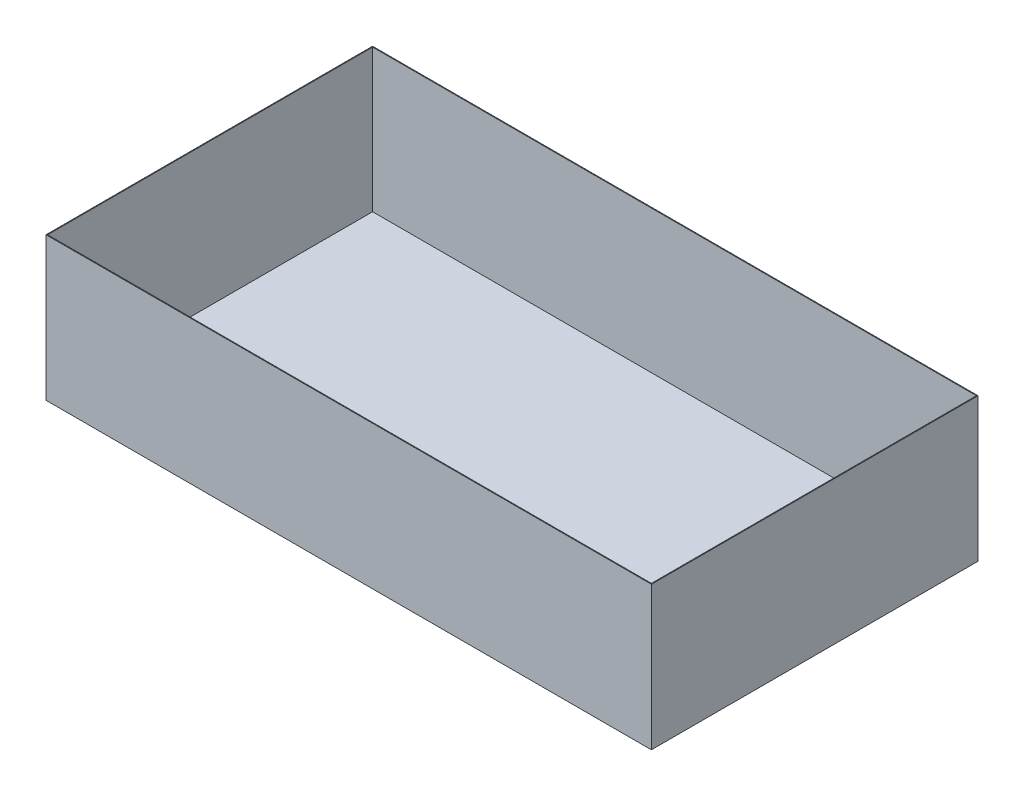
ISO-10303-21;
HEADER;
FILE_DESCRIPTION(('STEP AP214'),'2;1');
FILE_NAME('part.step','',(''),(''),'','','');
FILE_SCHEMA(('AUTOMOTIVE_DESIGN { 1 0 10303 214 1 1 1 1 }'));
ENDSEC;
DATA;
#1=APPLICATION_CONTEXT('core data for automotive mechanical design processes');
#2=APPLICATION_PROTOCOL_DEFINITION('international standard','automotive_design',2000,#1);
#3=PRODUCT_CONTEXT('',#1,'mechanical');
#4=PRODUCT('Part','Part','',(#3));
#5=PRODUCT_RELATED_PRODUCT_CATEGORY('part','',(#4));
#6=PRODUCT_DEFINITION_FORMATION('','',#4);
#7=PRODUCT_DEFINITION_CONTEXT('part definition',#1,'design');
#8=PRODUCT_DEFINITION('design','',#6,#7);
#9=PRODUCT_DEFINITION_SHAPE('','',#8);
#10=(LENGTH_UNIT() NAMED_UNIT(*) SI_UNIT(.MILLI.,.METRE.));
#11=(NAMED_UNIT(*) PLANE_ANGLE_UNIT() SI_UNIT($,.RADIAN.));
#12=(NAMED_UNIT(*) SI_UNIT($,.STERADIAN.) SOLID_ANGLE_UNIT());
#13=UNCERTAINTY_MEASURE_WITH_UNIT(LENGTH_MEASURE(1.E-05),#10,'distance_accuracy_value','');
#14=(GEOMETRIC_REPRESENTATION_CONTEXT(3) GLOBAL_UNCERTAINTY_ASSIGNED_CONTEXT((#13)) GLOBAL_UNIT_ASSIGNED_CONTEXT((#10,
#11,#12)) REPRESENTATION_CONTEXT('',''));
#15=CARTESIAN_POINT('',(0.,0.,0.));
#16=DIRECTION('',(0.,0.,1.));
#17=DIRECTION('',(1.,0.,0.));
#18=AXIS2_PLACEMENT_3D('',#15,#16,#17);
#19=CARTESIAN_POINT('',(-224.976152623211,180.,-90.5802861685215));
#20=DIRECTION('',(1.,0.,0.));
#21=DIRECTION('',(0.,0.,-1.));
#22=AXIS2_PLACEMENT_3D('',#19,#20,#21);
#23=PLANE('',#22);
#24=DIRECTION('',(0.,0.,1.));
#25=VECTOR('',#24,1.);
#26=CARTESIAN_POINT('',(-224.976152623211,0.,-90.5802861685215));
#27=LINE('',#26,#25);
#28=CARTESIAN_POINT('',(-224.976152623211,0.,-90.5802861685215));
#29=VERTEX_POINT('',#28);
#30=CARTESIAN_POINT('',(-224.976152623211,0.,319.419713831478));
#31=VERTEX_POINT('',#30);
#32=EDGE_CURVE('E151',#29,#31,#27,.T.);
#33=ORIENTED_EDGE('',*,*,#32,.T.);
#34=DIRECTION('',(0.,-1.,0.));
#35=VECTOR('',#34,1.);
#36=CARTESIAN_POINT('',(-224.976152623211,180.,319.419713831478));
#37=LINE('',#36,#35);
#38=CARTESIAN_POINT('',(-224.976152623211,180.,319.419713831478));
#39=VERTEX_POINT('',#38);
#40=EDGE_CURVE('E11',#39,#31,#37,.T.);
#41=ORIENTED_EDGE('',*,*,#40,.F.);
#42=DIRECTION('',(0.,0.,1.));
#43=VECTOR('',#42,1.);
#44=CARTESIAN_POINT('',(-224.976152623211,180.,-90.5802861685215));
#45=LINE('',#44,#43);
#46=CARTESIAN_POINT('',(-224.976152623211,180.,-90.5802861685215));
#47=VERTEX_POINT('',#46);
#48=EDGE_CURVE('E144',#47,#39,#45,.T.);
#49=ORIENTED_EDGE('',*,*,#48,.F.);
#50=DIRECTION('',(0.,-1.,0.));
#51=VECTOR('',#50,1.);
#52=CARTESIAN_POINT('',(-224.976152623211,180.,-90.5802861685215));
#53=LINE('',#52,#51);
#54=EDGE_CURVE('E150',#47,#29,#53,.T.);
#55=ORIENTED_EDGE('',*,*,#54,.T.);
#56=EDGE_LOOP('',(#33,#41,#49,#55));
#57=FACE_BOUND('',#56,.T.);
#58=ADVANCED_FACE('F37',(#57),#23,.F.);
#59=CARTESIAN_POINT('',(-224.976152623211,180.,319.419713831478));
#60=DIRECTION('',(0.,0.,-1.));
#61=DIRECTION('',(-1.,0.,0.));
#62=AXIS2_PLACEMENT_3D('',#59,#60,#61);
#63=PLANE('',#62);
#64=DIRECTION('',(1.,0.,0.));
#65=VECTOR('',#64,1.);
#66=CARTESIAN_POINT('',(-224.976152623211,0.,319.419713831478));
#67=LINE('',#66,#65);
#68=CARTESIAN_POINT('',(535.023847376789,0.,319.419713831478));
#69=VERTEX_POINT('',#68);
#70=EDGE_CURVE('E154',#31,#69,#67,.T.);
#71=ORIENTED_EDGE('',*,*,#70,.T.);
#72=DIRECTION('',(0.,-1.,0.));
#73=VECTOR('',#72,1.);
#74=CARTESIAN_POINT('',(535.023847376789,180.,319.419713831478));
#75=LINE('',#74,#73);
#76=CARTESIAN_POINT('',(535.023847376789,180.,319.419713831478));
#77=VERTEX_POINT('',#76);
#78=EDGE_CURVE('E44',#77,#69,#75,.T.);
#79=ORIENTED_EDGE('',*,*,#78,.F.);
#80=DIRECTION('',(1.,0.,0.));
#81=VECTOR('',#80,1.);
#82=CARTESIAN_POINT('',(-224.976152623211,180.,319.419713831478));
#83=LINE('',#82,#81);
#84=EDGE_CURVE('E88',#39,#77,#83,.T.);
#85=ORIENTED_EDGE('',*,*,#84,.F.);
#86=ORIENTED_EDGE('',*,*,#40,.T.);
#87=EDGE_LOOP('',(#71,#79,#85,#86));
#88=FACE_BOUND('',#87,.T.);
#89=ADVANCED_FACE('F183',(#88),#63,.F.);
#90=CARTESIAN_POINT('',(535.023847376789,180.,-90.5802861685215));
#91=DIRECTION('',(-1.,0.,0.));
#92=DIRECTION('',(0.,0.,1.));
#93=AXIS2_PLACEMENT_3D('',#90,#91,#92);
#94=PLANE('',#93);
#95=DIRECTION('',(0.,0.,-1.));
#96=VECTOR('',#95,1.);
#97=CARTESIAN_POINT('',(535.023847376789,0.,-90.5802861685215));
#98=LINE('',#97,#96);
#99=CARTESIAN_POINT('',(535.023847376789,0.,-90.5802861685215));
#100=VERTEX_POINT('',#99);
#101=EDGE_CURVE('E156',#69,#100,#98,.T.);
#102=ORIENTED_EDGE('',*,*,#101,.T.);
#103=DIRECTION('',(0.,-1.,0.));
#104=VECTOR('',#103,1.);
#105=CARTESIAN_POINT('',(535.023847376789,180.,-90.5802861685215));
#106=LINE('',#105,#104);
#107=CARTESIAN_POINT('',(535.023847376789,180.,-90.5802861685215));
#108=VERTEX_POINT('',#107);
#109=EDGE_CURVE('E160',#108,#100,#106,.T.);
#110=ORIENTED_EDGE('',*,*,#109,.F.);
#111=DIRECTION('',(0.,0.,-1.));
#112=VECTOR('',#111,1.);
#113=CARTESIAN_POINT('',(535.023847376789,180.,-90.5802861685215));
#114=LINE('',#113,#112);
#115=EDGE_CURVE('E147',#77,#108,#114,.T.);
#116=ORIENTED_EDGE('',*,*,#115,.F.);
#117=ORIENTED_EDGE('',*,*,#78,.T.);
#118=EDGE_LOOP('',(#102,#110,#116,#117));
#119=FACE_BOUND('',#118,.T.);
#120=ADVANCED_FACE('F165',(#119),#94,.F.);
#121=CARTESIAN_POINT('',(-224.976152623211,180.,-90.5802861685215));
#122=DIRECTION('',(0.,0.,1.));
#123=DIRECTION('',(1.,0.,0.));
#124=AXIS2_PLACEMENT_3D('',#121,#122,#123);
#125=PLANE('',#124);
#126=DIRECTION('',(-1.,0.,0.));
#127=VECTOR('',#126,1.);
#128=CARTESIAN_POINT('',(-224.976152623211,0.,-90.5802861685215));
#129=LINE('',#128,#127);
#130=EDGE_CURVE('E81',#100,#29,#129,.T.);
#131=ORIENTED_EDGE('',*,*,#130,.T.);
#132=ORIENTED_EDGE('',*,*,#54,.F.);
#133=DIRECTION('',(-1.,0.,0.));
#134=VECTOR('',#133,1.);
#135=CARTESIAN_POINT('',(-224.976152623211,180.,-90.5802861685215));
#136=LINE('',#135,#134);
#137=EDGE_CURVE('E60',#108,#47,#136,.T.);
#138=ORIENTED_EDGE('',*,*,#137,.F.);
#139=ORIENTED_EDGE('',*,*,#109,.T.);
#140=EDGE_LOOP('',(#131,#132,#138,#139));
#141=FACE_BOUND('',#140,.T.);
#142=ADVANCED_FACE('F173',(#141),#125,.F.);
#143=CARTESIAN_POINT('',(0.,180.,0.));
#144=DIRECTION('',(0.,1.,0.));
#145=DIRECTION('',(0.,0.,1.));
#146=AXIS2_PLACEMENT_3D('',#143,#144,#145);
#147=PLANE('',#146);
#148=DIRECTION('',(0.,0.,1.));
#149=VECTOR('',#148,1.);
#150=CARTESIAN_POINT('',(-223.976152623211,180.,-90.5802861685215));
#151=LINE('',#150,#149);
#152=CARTESIAN_POINT('',(-223.976152623211,180.,-89.5802861685215));
#153=VERTEX_POINT('',#152);
#154=CARTESIAN_POINT('',(-223.976152623211,180.,318.419713831478));
#155=VERTEX_POINT('',#154);
#156=EDGE_CURVE('E133',#153,#155,#151,.T.);
#157=ORIENTED_EDGE('',*,*,#156,.F.);
#158=DIRECTION('',(-1.,0.,0.));
#159=VECTOR('',#158,1.);
#160=CARTESIAN_POINT('',(-224.976152623211,180.,-89.5802861685215));
#161=LINE('',#160,#159);
#162=CARTESIAN_POINT('',(534.023847376789,180.,-89.5802861685215));
#163=VERTEX_POINT('',#162);
#164=EDGE_CURVE('E142',#163,#153,#161,.T.);
#165=ORIENTED_EDGE('',*,*,#164,.F.);
#166=DIRECTION('',(0.,0.,-1.));
#167=VECTOR('',#166,1.);
#168=CARTESIAN_POINT('',(534.023847376789,180.,-90.5802861685215));
#169=LINE('',#168,#167);
#170=CARTESIAN_POINT('',(534.023847376789,180.,318.419713831478));
#171=VERTEX_POINT('',#170);
#172=EDGE_CURVE('E140',#171,#163,#169,.T.);
#173=ORIENTED_EDGE('',*,*,#172,.F.);
#174=DIRECTION('',(1.,0.,0.));
#175=VECTOR('',#174,1.);
#176=CARTESIAN_POINT('',(-224.976152623211,180.,318.419713831478));
#177=LINE('',#176,#175);
#178=EDGE_CURVE('E125',#155,#171,#177,.T.);
#179=ORIENTED_EDGE('',*,*,#178,.F.);
#180=EDGE_LOOP('',(#157,#165,#173,#179));
#181=FACE_BOUND('',#180,.T.);
#182=ORIENTED_EDGE('',*,*,#48,.T.);
#183=ORIENTED_EDGE('',*,*,#84,.T.);
#184=ORIENTED_EDGE('',*,*,#115,.T.);
#185=ORIENTED_EDGE('',*,*,#137,.T.);
#186=EDGE_LOOP('',(#182,#183,#184,#185));
#187=FACE_BOUND('',#186,.T.);
#188=ADVANCED_FACE('F175',(#181,#187),#147,.T.);
#189=CARTESIAN_POINT('',(0.,0.,0.));
#190=DIRECTION('',(0.,1.,0.));
#191=DIRECTION('',(0.,0.,1.));
#192=AXIS2_PLACEMENT_3D('',#189,#190,#191);
#193=PLANE('',#192);
#194=ORIENTED_EDGE('',*,*,#32,.F.);
#195=ORIENTED_EDGE('',*,*,#130,.F.);
#196=ORIENTED_EDGE('',*,*,#101,.F.);
#197=ORIENTED_EDGE('',*,*,#70,.F.);
#198=EDGE_LOOP('',(#194,#195,#196,#197));
#199=FACE_BOUND('',#198,.T.);
#200=ADVANCED_FACE('F169',(#199),#193,.F.);
#201=CARTESIAN_POINT('',(-223.976152623211,180.,-90.5802861685215));
#202=DIRECTION('',(1.,0.,0.));
#203=DIRECTION('',(0.,0.,-1.));
#204=AXIS2_PLACEMENT_3D('',#201,#202,#203);
#205=PLANE('',#204);
#206=DIRECTION('',(0.,0.,1.));
#207=VECTOR('',#206,1.);
#208=CARTESIAN_POINT('',(-223.976152623211,1.,-90.5802861685215));
#209=LINE('',#208,#207);
#210=CARTESIAN_POINT('',(-223.976152623211,1.,-89.5802861685215));
#211=VERTEX_POINT('',#210);
#212=CARTESIAN_POINT('',(-223.976152623211,1.,318.419713831478));
#213=VERTEX_POINT('',#212);
#214=EDGE_CURVE('E116',#211,#213,#209,.T.);
#215=ORIENTED_EDGE('',*,*,#214,.F.);
#216=DIRECTION('',(0.,-1.,0.));
#217=VECTOR('',#216,1.);
#218=CARTESIAN_POINT('',(-223.976152623211,180.,-89.5802861685215));
#219=LINE('',#218,#217);
#220=EDGE_CURVE('E136',#153,#211,#219,.T.);
#221=ORIENTED_EDGE('',*,*,#220,.F.);
#222=ORIENTED_EDGE('',*,*,#156,.T.);
#223=DIRECTION('',(0.,-1.,0.));
#224=VECTOR('',#223,1.);
#225=CARTESIAN_POINT('',(-223.976152623211,180.,318.419713831478));
#226=LINE('',#225,#224);
#227=EDGE_CURVE('E128',#155,#213,#226,.T.);
#228=ORIENTED_EDGE('',*,*,#227,.T.);
#229=EDGE_LOOP('',(#215,#221,#222,#228));
#230=FACE_BOUND('',#229,.T.);
#231=ADVANCED_FACE('F210',(#230),#205,.T.);
#232=CARTESIAN_POINT('',(-224.976152623211,180.,318.419713831478));
#233=DIRECTION('',(0.,0.,-1.));
#234=DIRECTION('',(-1.,0.,0.));
#235=AXIS2_PLACEMENT_3D('',#232,#233,#234);
#236=PLANE('',#235);
#237=DIRECTION('',(1.,0.,0.));
#238=VECTOR('',#237,1.);
#239=CARTESIAN_POINT('',(-224.976152623211,1.,318.419713831478));
#240=LINE('',#239,#238);
#241=CARTESIAN_POINT('',(534.023847376789,1.,318.419713831478));
#242=VERTEX_POINT('',#241);
#243=EDGE_CURVE('E110',#213,#242,#240,.T.);
#244=ORIENTED_EDGE('',*,*,#243,.F.);
#245=ORIENTED_EDGE('',*,*,#227,.F.);
#246=ORIENTED_EDGE('',*,*,#178,.T.);
#247=DIRECTION('',(0.,-1.,0.));
#248=VECTOR('',#247,1.);
#249=CARTESIAN_POINT('',(534.023847376789,180.,318.419713831478));
#250=LINE('',#249,#248);
#251=EDGE_CURVE('E122',#171,#242,#250,.T.);
#252=ORIENTED_EDGE('',*,*,#251,.T.);
#253=EDGE_LOOP('',(#244,#245,#246,#252));
#254=FACE_BOUND('',#253,.T.);
#255=ADVANCED_FACE('F123',(#254),#236,.T.);
#256=CARTESIAN_POINT('',(534.023847376789,180.,-90.5802861685215));
#257=DIRECTION('',(-1.,0.,0.));
#258=DIRECTION('',(0.,0.,1.));
#259=AXIS2_PLACEMENT_3D('',#256,#257,#258);
#260=PLANE('',#259);
#261=DIRECTION('',(0.,0.,-1.));
#262=VECTOR('',#261,1.);
#263=CARTESIAN_POINT('',(534.023847376789,1.,-90.5802861685215));
#264=LINE('',#263,#262);
#265=CARTESIAN_POINT('',(534.023847376789,1.,-89.5802861685215));
#266=VERTEX_POINT('',#265);
#267=EDGE_CURVE('E114',#242,#266,#264,.T.);
#268=ORIENTED_EDGE('',*,*,#267,.F.);
#269=ORIENTED_EDGE('',*,*,#251,.F.);
#270=ORIENTED_EDGE('',*,*,#172,.T.);
#271=DIRECTION('',(0.,-1.,0.));
#272=VECTOR('',#271,1.);
#273=CARTESIAN_POINT('',(534.023847376789,180.,-89.5802861685215));
#274=LINE('',#273,#272);
#275=EDGE_CURVE('E51',#163,#266,#274,.T.);
#276=ORIENTED_EDGE('',*,*,#275,.T.);
#277=EDGE_LOOP('',(#268,#269,#270,#276));
#278=FACE_BOUND('',#277,.T.);
#279=ADVANCED_FACE('F130',(#278),#260,.T.);
#280=CARTESIAN_POINT('',(-224.976152623211,180.,-89.5802861685215));
#281=DIRECTION('',(0.,0.,1.));
#282=DIRECTION('',(1.,0.,0.));
#283=AXIS2_PLACEMENT_3D('',#280,#281,#282);
#284=PLANE('',#283);
#285=DIRECTION('',(-1.,0.,0.));
#286=VECTOR('',#285,1.);
#287=CARTESIAN_POINT('',(-224.976152623211,1.,-89.5802861685215));
#288=LINE('',#287,#286);
#289=EDGE_CURVE('E131',#266,#211,#288,.T.);
#290=ORIENTED_EDGE('',*,*,#289,.F.);
#291=ORIENTED_EDGE('',*,*,#275,.F.);
#292=ORIENTED_EDGE('',*,*,#164,.T.);
#293=ORIENTED_EDGE('',*,*,#220,.T.);
#294=EDGE_LOOP('',(#290,#291,#292,#293));
#295=FACE_BOUND('',#294,.T.);
#296=ADVANCED_FACE('F240',(#295),#284,.T.);
#297=CARTESIAN_POINT('',(0.,1.,0.));
#298=DIRECTION('',(0.,1.,0.));
#299=DIRECTION('',(0.,0.,1.));
#300=AXIS2_PLACEMENT_3D('',#297,#298,#299);
#301=PLANE('',#300);
#302=ORIENTED_EDGE('',*,*,#214,.T.);
#303=ORIENTED_EDGE('',*,*,#243,.T.);
#304=ORIENTED_EDGE('',*,*,#267,.T.);
#305=ORIENTED_EDGE('',*,*,#289,.T.);
#306=EDGE_LOOP('',(#302,#303,#304,#305));
#307=FACE_BOUND('',#306,.T.);
#308=ADVANCED_FACE('F112',(#307),#301,.T.);
#309=CLOSED_SHELL('',(#58,#89,#120,#142,#188,#200,#231,#255,#279,#296,#308));
#310=MANIFOLD_SOLID_BREP('B2',#309);
#311=ADVANCED_BREP_SHAPE_REPRESENTATION('',(#18,#310),#14);
#312=SHAPE_DEFINITION_REPRESENTATION(#9,#311);
ENDSEC;
END-ISO-10303-21;
